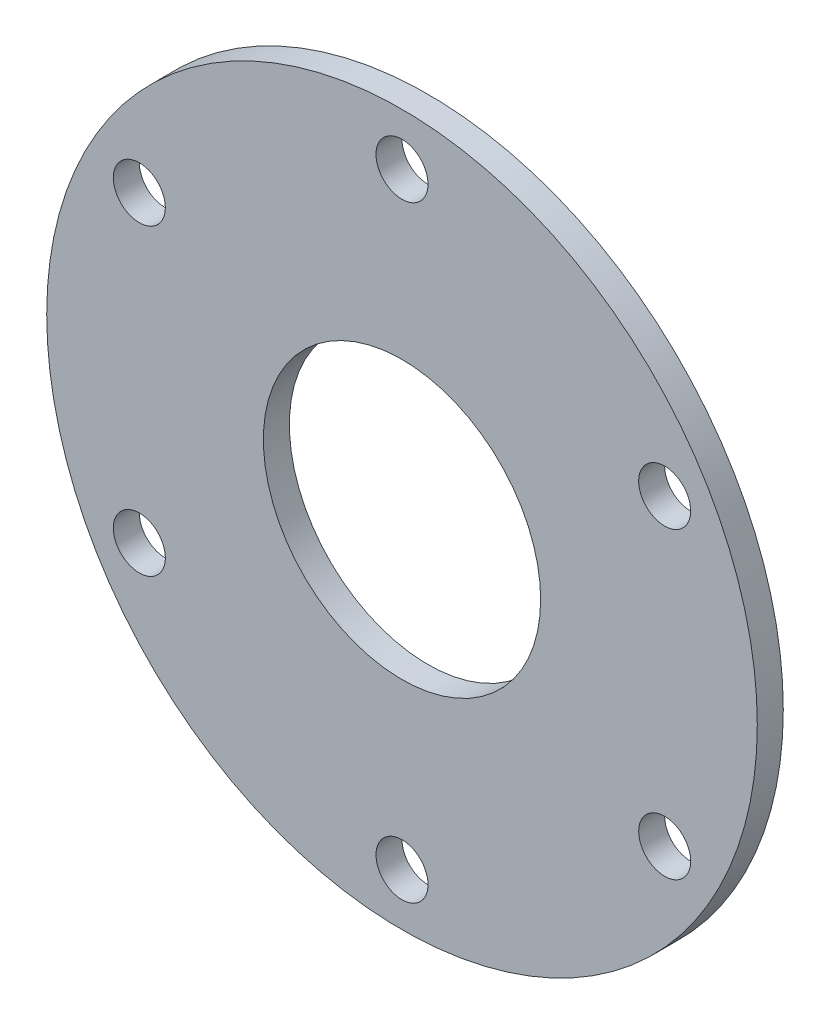
ISO-10303-21;
HEADER;
FILE_DESCRIPTION(('STEP AP214'),'2;1');
FILE_NAME('part.step','',(''),(''),'','','');
FILE_SCHEMA(('AUTOMOTIVE_DESIGN { 1 0 10303 214 1 1 1 1 }'));
ENDSEC;
DATA;
#1=APPLICATION_CONTEXT('core data for automotive mechanical design processes');
#2=APPLICATION_PROTOCOL_DEFINITION('international standard','automotive_design',2000,#1);
#3=PRODUCT_CONTEXT('',#1,'mechanical');
#4=PRODUCT('Part','Part','',(#3));
#5=PRODUCT_RELATED_PRODUCT_CATEGORY('part','',(#4));
#6=PRODUCT_DEFINITION_FORMATION('','',#4);
#7=PRODUCT_DEFINITION_CONTEXT('part definition',#1,'design');
#8=PRODUCT_DEFINITION('design','',#6,#7);
#9=PRODUCT_DEFINITION_SHAPE('','',#8);
#10=(LENGTH_UNIT() NAMED_UNIT(*) SI_UNIT(.MILLI.,.METRE.));
#11=(NAMED_UNIT(*) PLANE_ANGLE_UNIT() SI_UNIT($,.RADIAN.));
#12=(NAMED_UNIT(*) SI_UNIT($,.STERADIAN.) SOLID_ANGLE_UNIT());
#13=UNCERTAINTY_MEASURE_WITH_UNIT(LENGTH_MEASURE(1.E-05),#10,'distance_accuracy_value','');
#14=(GEOMETRIC_REPRESENTATION_CONTEXT(3) GLOBAL_UNCERTAINTY_ASSIGNED_CONTEXT((#13)) GLOBAL_UNIT_ASSIGNED_CONTEXT((#10,
#11,#12)) REPRESENTATION_CONTEXT('',''));
#15=CARTESIAN_POINT('',(0.,0.,0.));
#16=DIRECTION('',(0.,0.,1.));
#17=DIRECTION('',(1.,0.,0.));
#18=AXIS2_PLACEMENT_3D('',#15,#16,#17);
#19=CARTESIAN_POINT('',(0.,0.,3.));
#20=DIRECTION('',(0.,0.,-1.));
#21=DIRECTION('',(-1.,0.,0.));
#22=AXIS2_PLACEMENT_3D('',#19,#20,#21);
#23=CYLINDRICAL_SURFACE('',#22,41.);
#24=CARTESIAN_POINT('',(0.,0.,3.));
#25=DIRECTION('',(0.,0.,1.));
#26=DIRECTION('',(1.,0.,0.));
#27=AXIS2_PLACEMENT_3D('',#24,#25,#26);
#28=CIRCLE('',#27,41.);
#29=CARTESIAN_POINT('',(41.,0.,3.));
#30=VERTEX_POINT('',#29);
#31=EDGE_CURVE('E10',#30,#30,#28,.T.);
#32=ORIENTED_EDGE('',*,*,#31,.F.);
#33=EDGE_LOOP('',(#32));
#34=FACE_BOUND('',#33,.T.);
#35=CARTESIAN_POINT('',(0.,0.,0.));
#36=DIRECTION('',(0.,0.,1.));
#37=DIRECTION('',(1.,0.,0.));
#38=AXIS2_PLACEMENT_3D('',#35,#36,#37);
#39=CIRCLE('',#38,41.);
#40=CARTESIAN_POINT('',(41.,0.,0.));
#41=VERTEX_POINT('',#40);
#42=EDGE_CURVE('E35',#41,#41,#39,.T.);
#43=ORIENTED_EDGE('',*,*,#42,.T.);
#44=EDGE_LOOP('',(#43));
#45=FACE_BOUND('',#44,.T.);
#46=ADVANCED_FACE('F32',(#34,#45),#23,.T.);
#47=CARTESIAN_POINT('',(0.,0.,3.));
#48=DIRECTION('',(0.,0.,1.));
#49=DIRECTION('',(1.,0.,0.));
#50=AXIS2_PLACEMENT_3D('',#47,#48,#49);
#51=PLANE('',#50);
#52=CARTESIAN_POINT('',(0.,0.,3.));
#53=DIRECTION('',(0.,0.,1.));
#54=DIRECTION('',(1.,0.,0.));
#55=AXIS2_PLACEMENT_3D('',#52,#53,#54);
#56=CIRCLE('',#55,16.);
#57=CARTESIAN_POINT('',(16.,0.,3.));
#58=VERTEX_POINT('',#57);
#59=EDGE_CURVE('E82',#58,#58,#56,.T.);
#60=ORIENTED_EDGE('',*,*,#59,.F.);
#61=EDGE_LOOP('',(#60));
#62=FACE_BOUND('',#61,.T.);
#63=CARTESIAN_POINT('',(30.3108891324552,17.5000000000004,3.));
#64=DIRECTION('',(0.,0.,-1.));
#65=DIRECTION('',(-0.50000000000001,0.866025403784433,0.));
#66=AXIS2_PLACEMENT_3D('',#63,#64,#65);
#67=CIRCLE('',#66,3.);
#68=CARTESIAN_POINT('',(28.8108891324551,20.0980762113537,3.));
#69=VERTEX_POINT('',#68);
#70=EDGE_CURVE('E59',#69,#69,#67,.T.);
#71=ORIENTED_EDGE('',*,*,#70,.T.);
#72=EDGE_LOOP('',(#71));
#73=FACE_BOUND('',#72,.T.);
#74=CARTESIAN_POINT('',(30.3108891324555,-17.4999999999997,3.));
#75=DIRECTION('',(0.,0.,-1.));
#76=DIRECTION('',(0.499999999999992,0.866025403784443,0.));
#77=AXIS2_PLACEMENT_3D('',#74,#75,#76);
#78=CIRCLE('',#77,3.);
#79=CARTESIAN_POINT('',(31.8108891324555,-14.9019237886464,3.));
#80=VERTEX_POINT('',#79);
#81=EDGE_CURVE('E66',#80,#80,#78,.T.);
#82=ORIENTED_EDGE('',*,*,#81,.T.);
#83=EDGE_LOOP('',(#82));
#84=FACE_BOUND('',#83,.T.);
#85=CARTESIAN_POINT('',(0.,-35.,3.));
#86=DIRECTION('',(0.,0.,-1.));
#87=DIRECTION('',(1.,0.,0.));
#88=AXIS2_PLACEMENT_3D('',#85,#86,#87);
#89=CIRCLE('',#88,3.);
#90=CARTESIAN_POINT('',(3.,-35.,3.));
#91=VERTEX_POINT('',#90);
#92=EDGE_CURVE('E72',#91,#91,#89,.T.);
#93=ORIENTED_EDGE('',*,*,#92,.T.);
#94=EDGE_LOOP('',(#93));
#95=FACE_BOUND('',#94,.T.);
#96=CARTESIAN_POINT('',(-30.3108891324553,-17.5000000000001,3.));
#97=DIRECTION('',(0.,0.,-1.));
#98=DIRECTION('',(0.500000000000004,-0.866025403784436,0.));
#99=AXIS2_PLACEMENT_3D('',#96,#97,#98);
#100=CIRCLE('',#99,3.);
#101=CARTESIAN_POINT('',(-28.8108891324553,-20.0980762113535,3.));
#102=VERTEX_POINT('',#101);
#103=EDGE_CURVE('E53',#102,#102,#100,.T.);
#104=ORIENTED_EDGE('',*,*,#103,.T.);
#105=EDGE_LOOP('',(#104));
#106=FACE_BOUND('',#105,.T.);
#107=CARTESIAN_POINT('',(-30.3108891324554,17.4999999999999,3.));
#108=DIRECTION('',(0.,0.,-1.));
#109=DIRECTION('',(-0.499999999999998,-0.86602540378444,0.));
#110=AXIS2_PLACEMENT_3D('',#107,#108,#109);
#111=CIRCLE('',#110,3.);
#112=CARTESIAN_POINT('',(-31.8108891324554,14.9019237886466,3.));
#113=VERTEX_POINT('',#112);
#114=EDGE_CURVE('E47',#113,#113,#111,.T.);
#115=ORIENTED_EDGE('',*,*,#114,.T.);
#116=EDGE_LOOP('',(#115));
#117=FACE_BOUND('',#116,.T.);
#118=CARTESIAN_POINT('',(0.,35.,3.));
#119=DIRECTION('',(0.,0.,-1.));
#120=DIRECTION('',(-1.,0.,0.));
#121=AXIS2_PLACEMENT_3D('',#118,#119,#120);
#122=CIRCLE('',#121,3.);
#123=CARTESIAN_POINT('',(-3.,35.,3.));
#124=VERTEX_POINT('',#123);
#125=EDGE_CURVE('E42',#124,#124,#122,.T.);
#126=ORIENTED_EDGE('',*,*,#125,.T.);
#127=EDGE_LOOP('',(#126));
#128=FACE_BOUND('',#127,.T.);
#129=ORIENTED_EDGE('',*,*,#31,.T.);
#130=EDGE_LOOP('',(#129));
#131=FACE_BOUND('',#130,.T.);
#132=ADVANCED_FACE('F89',(#62,#73,#84,#95,#106,#117,#128,#131),#51,.T.);
#133=CARTESIAN_POINT('',(0.,0.,0.));
#134=DIRECTION('',(0.,0.,1.));
#135=DIRECTION('',(1.,0.,0.));
#136=AXIS2_PLACEMENT_3D('',#133,#134,#135);
#137=PLANE('',#136);
#138=CARTESIAN_POINT('',(0.,0.,0.));
#139=DIRECTION('',(0.,0.,1.));
#140=DIRECTION('',(1.,0.,0.));
#141=AXIS2_PLACEMENT_3D('',#138,#139,#140);
#142=CIRCLE('',#141,16.);
#143=CARTESIAN_POINT('',(16.,0.,0.));
#144=VERTEX_POINT('',#143);
#145=EDGE_CURVE('E60',#144,#144,#142,.F.);
#146=ORIENTED_EDGE('',*,*,#145,.F.);
#147=EDGE_LOOP('',(#146));
#148=FACE_BOUND('',#147,.T.);
#149=CARTESIAN_POINT('',(30.3108891324552,17.5000000000004,0.));
#150=DIRECTION('',(0.,0.,-1.));
#151=DIRECTION('',(-0.50000000000001,0.866025403784433,0.));
#152=AXIS2_PLACEMENT_3D('',#149,#150,#151);
#153=CIRCLE('',#152,3.);
#154=CARTESIAN_POINT('',(28.8108891324551,20.0980762113537,0.));
#155=VERTEX_POINT('',#154);
#156=EDGE_CURVE('E56',#155,#155,#153,.T.);
#157=ORIENTED_EDGE('',*,*,#156,.F.);
#158=EDGE_LOOP('',(#157));
#159=FACE_BOUND('',#158,.T.);
#160=CARTESIAN_POINT('',(30.3108891324555,-17.4999999999997,0.));
#161=DIRECTION('',(0.,0.,-1.));
#162=DIRECTION('',(0.499999999999992,0.866025403784443,0.));
#163=AXIS2_PLACEMENT_3D('',#160,#161,#162);
#164=CIRCLE('',#163,3.);
#165=CARTESIAN_POINT('',(31.8108891324555,-14.9019237886464,0.));
#166=VERTEX_POINT('',#165);
#167=EDGE_CURVE('E63',#166,#166,#164,.T.);
#168=ORIENTED_EDGE('',*,*,#167,.F.);
#169=EDGE_LOOP('',(#168));
#170=FACE_BOUND('',#169,.T.);
#171=CARTESIAN_POINT('',(0.,-35.,0.));
#172=DIRECTION('',(0.,0.,-1.));
#173=DIRECTION('',(1.,0.,0.));
#174=AXIS2_PLACEMENT_3D('',#171,#172,#173);
#175=CIRCLE('',#174,3.);
#176=CARTESIAN_POINT('',(3.,-35.,0.));
#177=VERTEX_POINT('',#176);
#178=EDGE_CURVE('E69',#177,#177,#175,.T.);
#179=ORIENTED_EDGE('',*,*,#178,.F.);
#180=EDGE_LOOP('',(#179));
#181=FACE_BOUND('',#180,.T.);
#182=CARTESIAN_POINT('',(-30.3108891324553,-17.5000000000001,0.));
#183=DIRECTION('',(0.,0.,-1.));
#184=DIRECTION('',(0.500000000000004,-0.866025403784436,0.));
#185=AXIS2_PLACEMENT_3D('',#182,#183,#184);
#186=CIRCLE('',#185,3.);
#187=CARTESIAN_POINT('',(-28.8108891324553,-20.0980762113535,0.));
#188=VERTEX_POINT('',#187);
#189=EDGE_CURVE('E75',#188,#188,#186,.T.);
#190=ORIENTED_EDGE('',*,*,#189,.F.);
#191=EDGE_LOOP('',(#190));
#192=FACE_BOUND('',#191,.T.);
#193=CARTESIAN_POINT('',(-30.3108891324554,17.4999999999999,0.));
#194=DIRECTION('',(0.,0.,-1.));
#195=DIRECTION('',(-0.499999999999998,-0.86602540378444,0.));
#196=AXIS2_PLACEMENT_3D('',#193,#194,#195);
#197=CIRCLE('',#196,3.);
#198=CARTESIAN_POINT('',(-31.8108891324554,14.9019237886466,0.));
#199=VERTEX_POINT('',#198);
#200=EDGE_CURVE('E50',#199,#199,#197,.T.);
#201=ORIENTED_EDGE('',*,*,#200,.F.);
#202=EDGE_LOOP('',(#201));
#203=FACE_BOUND('',#202,.T.);
#204=CARTESIAN_POINT('',(0.,35.,0.));
#205=DIRECTION('',(0.,0.,-1.));
#206=DIRECTION('',(-1.,0.,0.));
#207=AXIS2_PLACEMENT_3D('',#204,#205,#206);
#208=CIRCLE('',#207,3.);
#209=CARTESIAN_POINT('',(-3.,35.,0.));
#210=VERTEX_POINT('',#209);
#211=EDGE_CURVE('E44',#210,#210,#208,.T.);
#212=ORIENTED_EDGE('',*,*,#211,.F.);
#213=EDGE_LOOP('',(#212));
#214=FACE_BOUND('',#213,.T.);
#215=ORIENTED_EDGE('',*,*,#42,.F.);
#216=EDGE_LOOP('',(#215));
#217=FACE_BOUND('',#216,.T.);
#218=ADVANCED_FACE('F92',(#148,#159,#170,#181,#192,#203,#214,#217),#137,.F.);
#219=CARTESIAN_POINT('',(0.,35.,3.));
#220=DIRECTION('',(0.,0.,-1.));
#221=DIRECTION('',(-1.,0.,0.));
#222=AXIS2_PLACEMENT_3D('',#219,#220,#221);
#223=CYLINDRICAL_SURFACE('',#222,3.);
#224=ORIENTED_EDGE('',*,*,#125,.F.);
#225=EDGE_LOOP('',(#224));
#226=FACE_BOUND('',#225,.T.);
#227=ORIENTED_EDGE('',*,*,#211,.T.);
#228=EDGE_LOOP('',(#227));
#229=FACE_BOUND('',#228,.T.);
#230=ADVANCED_FACE('F106',(#226,#229),#223,.F.);
#231=CARTESIAN_POINT('',(-30.3108891324554,17.4999999999999,3.));
#232=DIRECTION('',(0.,0.,-1.));
#233=DIRECTION('',(-1.,0.,0.));
#234=AXIS2_PLACEMENT_3D('',#231,#232,#233);
#235=CYLINDRICAL_SURFACE('',#234,3.);
#236=ORIENTED_EDGE('',*,*,#114,.F.);
#237=EDGE_LOOP('',(#236));
#238=FACE_BOUND('',#237,.T.);
#239=ORIENTED_EDGE('',*,*,#200,.T.);
#240=EDGE_LOOP('',(#239));
#241=FACE_BOUND('',#240,.T.);
#242=ADVANCED_FACE('F109',(#238,#241),#235,.F.);
#243=CARTESIAN_POINT('',(-30.3108891324553,-17.5000000000001,3.));
#244=DIRECTION('',(0.,0.,-1.));
#245=DIRECTION('',(-1.,0.,0.));
#246=AXIS2_PLACEMENT_3D('',#243,#244,#245);
#247=CYLINDRICAL_SURFACE('',#246,3.);
#248=ORIENTED_EDGE('',*,*,#103,.F.);
#249=EDGE_LOOP('',(#248));
#250=FACE_BOUND('',#249,.T.);
#251=ORIENTED_EDGE('',*,*,#189,.T.);
#252=EDGE_LOOP('',(#251));
#253=FACE_BOUND('',#252,.T.);
#254=ADVANCED_FACE('F142',(#250,#253),#247,.F.);
#255=CARTESIAN_POINT('',(0.,-35.,3.));
#256=DIRECTION('',(0.,0.,-1.));
#257=DIRECTION('',(-1.,0.,0.));
#258=AXIS2_PLACEMENT_3D('',#255,#256,#257);
#259=CYLINDRICAL_SURFACE('',#258,3.);
#260=ORIENTED_EDGE('',*,*,#92,.F.);
#261=EDGE_LOOP('',(#260));
#262=FACE_BOUND('',#261,.T.);
#263=ORIENTED_EDGE('',*,*,#178,.T.);
#264=EDGE_LOOP('',(#263));
#265=FACE_BOUND('',#264,.T.);
#266=ADVANCED_FACE('F150',(#262,#265),#259,.F.);
#267=CARTESIAN_POINT('',(30.3108891324555,-17.4999999999997,3.));
#268=DIRECTION('',(0.,0.,-1.));
#269=DIRECTION('',(-1.,0.,0.));
#270=AXIS2_PLACEMENT_3D('',#267,#268,#269);
#271=CYLINDRICAL_SURFACE('',#270,3.);
#272=ORIENTED_EDGE('',*,*,#81,.F.);
#273=EDGE_LOOP('',(#272));
#274=FACE_BOUND('',#273,.T.);
#275=ORIENTED_EDGE('',*,*,#167,.T.);
#276=EDGE_LOOP('',(#275));
#277=FACE_BOUND('',#276,.T.);
#278=ADVANCED_FACE('F158',(#274,#277),#271,.F.);
#279=CARTESIAN_POINT('',(30.3108891324552,17.5000000000004,3.));
#280=DIRECTION('',(0.,0.,-1.));
#281=DIRECTION('',(-1.,0.,0.));
#282=AXIS2_PLACEMENT_3D('',#279,#280,#281);
#283=CYLINDRICAL_SURFACE('',#282,3.);
#284=ORIENTED_EDGE('',*,*,#70,.F.);
#285=EDGE_LOOP('',(#284));
#286=FACE_BOUND('',#285,.T.);
#287=ORIENTED_EDGE('',*,*,#156,.T.);
#288=EDGE_LOOP('',(#287));
#289=FACE_BOUND('',#288,.T.);
#290=ADVANCED_FACE('F166',(#286,#289),#283,.F.);
#291=CARTESIAN_POINT('',(0.,0.,-0.00100000000000013));
#292=DIRECTION('',(0.,0.,1.));
#293=DIRECTION('',(1.,0.,0.));
#294=AXIS2_PLACEMENT_3D('',#291,#292,#293);
#295=CYLINDRICAL_SURFACE('',#294,16.);
#296=ORIENTED_EDGE('',*,*,#59,.T.);
#297=EDGE_LOOP('',(#296));
#298=FACE_BOUND('',#297,.T.);
#299=ORIENTED_EDGE('',*,*,#145,.T.);
#300=EDGE_LOOP('',(#299));
#301=FACE_BOUND('',#300,.T.);
#302=ADVANCED_FACE('F86',(#298,#301),#295,.F.);
#303=CLOSED_SHELL('',(#46,#132,#218,#230,#242,#254,#266,#278,#290,#302));
#304=MANIFOLD_SOLID_BREP('B2',#303);
#305=ADVANCED_BREP_SHAPE_REPRESENTATION('',(#18,#304),#14);
#306=SHAPE_DEFINITION_REPRESENTATION(#9,#305);
ENDSEC;
END-ISO-10303-21;
